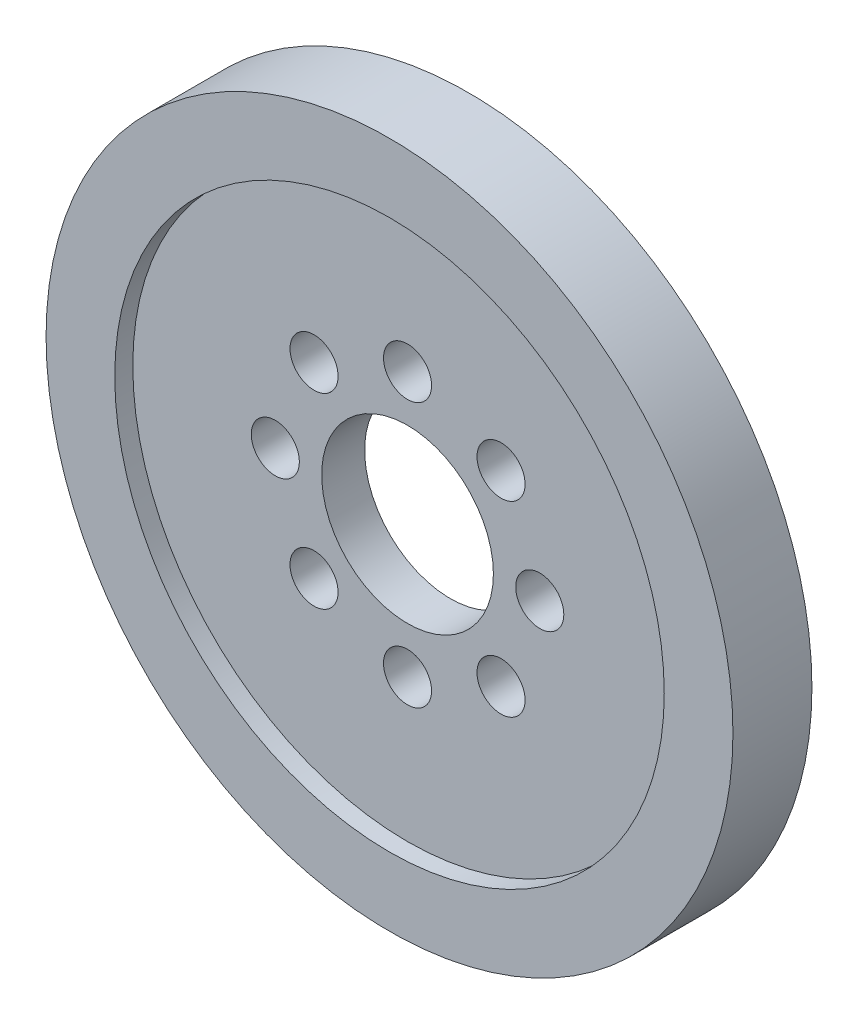
ISO-10303-21;
HEADER;
FILE_DESCRIPTION(('STEP AP214'),'2;1');
FILE_NAME('part.step','',(''),(''),'','','');
FILE_SCHEMA(('AUTOMOTIVE_DESIGN { 1 0 10303 214 1 1 1 1 }'));
ENDSEC;
DATA;
#1=APPLICATION_CONTEXT('core data for automotive mechanical design processes');
#2=APPLICATION_PROTOCOL_DEFINITION('international standard','automotive_design',2000,#1);
#3=PRODUCT_CONTEXT('',#1,'mechanical');
#4=PRODUCT('Part','Part','',(#3));
#5=PRODUCT_RELATED_PRODUCT_CATEGORY('part','',(#4));
#6=PRODUCT_DEFINITION_FORMATION('','',#4);
#7=PRODUCT_DEFINITION_CONTEXT('part definition',#1,'design');
#8=PRODUCT_DEFINITION('design','',#6,#7);
#9=PRODUCT_DEFINITION_SHAPE('','',#8);
#10=(LENGTH_UNIT() NAMED_UNIT(*) SI_UNIT(.MILLI.,.METRE.));
#11=(NAMED_UNIT(*) PLANE_ANGLE_UNIT() SI_UNIT($,.RADIAN.));
#12=(NAMED_UNIT(*) SI_UNIT($,.STERADIAN.) SOLID_ANGLE_UNIT());
#13=UNCERTAINTY_MEASURE_WITH_UNIT(LENGTH_MEASURE(1.E-05),#10,'distance_accuracy_value','');
#14=(GEOMETRIC_REPRESENTATION_CONTEXT(3) GLOBAL_UNCERTAINTY_ASSIGNED_CONTEXT((#13)) GLOBAL_UNIT_ASSIGNED_CONTEXT((#10,
#11,#12)) REPRESENTATION_CONTEXT('',''));
#15=CARTESIAN_POINT('',(0.,0.,0.));
#16=DIRECTION('',(0.,0.,1.));
#17=DIRECTION('',(1.,0.,0.));
#18=AXIS2_PLACEMENT_3D('',#15,#16,#17);
#19=CARTESIAN_POINT('',(0.,0.,2.921));
#20=DIRECTION('',(0.,0.,-1.));
#21=DIRECTION('',(-1.,0.,0.));
#22=AXIS2_PLACEMENT_3D('',#19,#20,#21);
#23=CYLINDRICAL_SURFACE('',#22,20.32);
#24=CARTESIAN_POINT('',(0.,0.,-2.921));
#25=DIRECTION('',(0.,0.,1.));
#26=DIRECTION('',(1.,0.,0.));
#27=AXIS2_PLACEMENT_3D('',#24,#25,#26);
#28=CIRCLE('',#27,20.32);
#29=CARTESIAN_POINT('',(20.32,0.,-2.921));
#30=VERTEX_POINT('',#29);
#31=EDGE_CURVE('E50',#30,#30,#28,.T.);
#32=ORIENTED_EDGE('',*,*,#31,.F.);
#33=EDGE_LOOP('',(#32));
#34=FACE_BOUND('',#33,.T.);
#35=CARTESIAN_POINT('',(0.,0.,-1.5875));
#36=DIRECTION('',(0.,0.,1.));
#37=DIRECTION('',(1.,0.,0.));
#38=AXIS2_PLACEMENT_3D('',#35,#36,#37);
#39=CIRCLE('',#38,20.32);
#40=CARTESIAN_POINT('',(20.32,0.,-1.5875));
#41=VERTEX_POINT('',#40);
#42=EDGE_CURVE('E53',#41,#41,#39,.T.);
#43=ORIENTED_EDGE('',*,*,#42,.T.);
#44=EDGE_LOOP('',(#43));
#45=FACE_BOUND('',#44,.T.);
#46=ADVANCED_FACE('F32',(#34,#45),#23,.F.);
#47=CARTESIAN_POINT('',(0.,0.,2.921));
#48=DIRECTION('',(0.,0.,1.));
#49=DIRECTION('',(1.,0.,0.));
#50=AXIS2_PLACEMENT_3D('',#47,#48,#49);
#51=PLANE('',#50);
#52=CARTESIAN_POINT('',(0.,0.,2.921));
#53=DIRECTION('',(0.,0.,1.));
#54=DIRECTION('',(1.,0.,0.));
#55=AXIS2_PLACEMENT_3D('',#52,#53,#54);
#56=CIRCLE('',#55,25.4);
#57=CARTESIAN_POINT('',(25.4,0.,2.921));
#58=VERTEX_POINT('',#57);
#59=EDGE_CURVE('E39',#58,#58,#56,.T.);
#60=ORIENTED_EDGE('',*,*,#59,.T.);
#61=EDGE_LOOP('',(#60));
#62=FACE_BOUND('',#61,.T.);
#63=CARTESIAN_POINT('',(0.,0.,2.921));
#64=DIRECTION('',(0.,0.,1.));
#65=DIRECTION('',(1.,0.,0.));
#66=AXIS2_PLACEMENT_3D('',#63,#64,#65);
#67=CIRCLE('',#66,20.32);
#68=CARTESIAN_POINT('',(20.32,0.,2.921));
#69=VERTEX_POINT('',#68);
#70=EDGE_CURVE('E48',#69,#69,#67,.T.);
#71=ORIENTED_EDGE('',*,*,#70,.F.);
#72=EDGE_LOOP('',(#71));
#73=FACE_BOUND('',#72,.T.);
#74=ADVANCED_FACE('F135',(#62,#73),#51,.T.);
#75=CARTESIAN_POINT('',(0.,0.,-2.921));
#76=DIRECTION('',(0.,0.,1.));
#77=DIRECTION('',(1.,0.,0.));
#78=AXIS2_PLACEMENT_3D('',#75,#76,#77);
#79=PLANE('',#78);
#80=CARTESIAN_POINT('',(0.,0.,-2.921));
#81=DIRECTION('',(0.,0.,1.));
#82=DIRECTION('',(1.,0.,0.));
#83=AXIS2_PLACEMENT_3D('',#80,#81,#82);
#84=CIRCLE('',#83,25.4);
#85=CARTESIAN_POINT('',(25.4,0.,-2.921));
#86=VERTEX_POINT('',#85);
#87=EDGE_CURVE('E43',#86,#86,#84,.T.);
#88=ORIENTED_EDGE('',*,*,#87,.F.);
#89=EDGE_LOOP('',(#88));
#90=FACE_BOUND('',#89,.T.);
#91=ORIENTED_EDGE('',*,*,#31,.T.);
#92=EDGE_LOOP('',(#91));
#93=FACE_BOUND('',#92,.T.);
#94=ADVANCED_FACE('F140',(#90,#93),#79,.F.);
#95=CARTESIAN_POINT('',(0.,0.,2.921));
#96=DIRECTION('',(0.,0.,-1.));
#97=DIRECTION('',(-1.,0.,0.));
#98=AXIS2_PLACEMENT_3D('',#95,#96,#97);
#99=CYLINDRICAL_SURFACE('',#98,25.4);
#100=ORIENTED_EDGE('',*,*,#59,.F.);
#101=EDGE_LOOP('',(#100));
#102=FACE_BOUND('',#101,.T.);
#103=ORIENTED_EDGE('',*,*,#87,.T.);
#104=EDGE_LOOP('',(#103));
#105=FACE_BOUND('',#104,.T.);
#106=ADVANCED_FACE('F34',(#102,#105),#99,.T.);
#107=CARTESIAN_POINT('',(0.,0.,1.5875));
#108=DIRECTION('',(0.,0.,1.));
#109=DIRECTION('',(1.,0.,0.));
#110=AXIS2_PLACEMENT_3D('',#107,#108,#109);
#111=CIRCLE('',#110,20.32);
#112=CARTESIAN_POINT('',(20.32,0.,1.5875));
#113=VERTEX_POINT('',#112);
#114=EDGE_CURVE('E10',#113,#113,#111,.T.);
#115=ORIENTED_EDGE('',*,*,#114,.F.);
#116=EDGE_LOOP('',(#115));
#117=FACE_BOUND('',#116,.T.);
#118=ORIENTED_EDGE('',*,*,#70,.T.);
#119=EDGE_LOOP('',(#118));
#120=FACE_BOUND('',#119,.T.);
#121=ADVANCED_FACE('F119',(#117,#120),#23,.F.);
#122=CARTESIAN_POINT('',(0.,0.,1.5875));
#123=DIRECTION('',(0.,0.,1.));
#124=DIRECTION('',(1.,0.,0.));
#125=AXIS2_PLACEMENT_3D('',#122,#123,#124);
#126=PLANE('',#125);
#127=CARTESIAN_POINT('',(-9.779,1.02429588037641E-13,1.5875));
#128=DIRECTION('',(0.,0.,1.));
#129=DIRECTION('',(1.,0.,0.));
#130=AXIS2_PLACEMENT_3D('',#127,#128,#129);
#131=CIRCLE('',#130,1.778);
#132=CARTESIAN_POINT('',(-8.001,1.02429588037641E-13,1.5875));
#133=VERTEX_POINT('',#132);
#134=EDGE_CURVE('E98',#133,#133,#131,.T.);
#135=ORIENTED_EDGE('',*,*,#134,.F.);
#136=EDGE_LOOP('',(#135));
#137=FACE_BOUND('',#136,.T.);
#138=CARTESIAN_POINT('',(0.,-9.779,1.5875));
#139=DIRECTION('',(0.,0.,1.));
#140=DIRECTION('',(1.,0.,0.));
#141=AXIS2_PLACEMENT_3D('',#138,#139,#140);
#142=CIRCLE('',#141,1.778);
#143=CARTESIAN_POINT('',(1.77799999999993,-9.779,1.5875));
#144=VERTEX_POINT('',#143);
#145=EDGE_CURVE('E86',#144,#144,#142,.T.);
#146=ORIENTED_EDGE('',*,*,#145,.F.);
#147=EDGE_LOOP('',(#146));
#148=FACE_BOUND('',#147,.T.);
#149=CARTESIAN_POINT('',(9.779,0.,1.5875));
#150=DIRECTION('',(0.,0.,1.));
#151=DIRECTION('',(1.,0.,0.));
#152=AXIS2_PLACEMENT_3D('',#149,#150,#151);
#153=CIRCLE('',#152,1.778);
#154=CARTESIAN_POINT('',(11.557,0.,1.5875));
#155=VERTEX_POINT('',#154);
#156=EDGE_CURVE('E74',#155,#155,#153,.T.);
#157=ORIENTED_EDGE('',*,*,#156,.F.);
#158=EDGE_LOOP('',(#157));
#159=FACE_BOUND('',#158,.T.);
#160=CARTESIAN_POINT('',(0.,9.779,1.5875));
#161=DIRECTION('',(0.,0.,1.));
#162=DIRECTION('',(1.,0.,0.));
#163=AXIS2_PLACEMENT_3D('',#160,#161,#162);
#164=CIRCLE('',#163,1.778);
#165=CARTESIAN_POINT('',(1.778,9.779,1.5875));
#166=VERTEX_POINT('',#165);
#167=EDGE_CURVE('E62',#166,#166,#164,.T.);
#168=ORIENTED_EDGE('',*,*,#167,.F.);
#169=EDGE_LOOP('',(#168));
#170=FACE_BOUND('',#169,.T.);
#171=ORIENTED_EDGE('',*,*,#114,.T.);
#172=EDGE_LOOP('',(#171));
#173=FACE_BOUND('',#172,.T.);
#174=CARTESIAN_POINT('',(0.,0.,1.5875));
#175=DIRECTION('',(0.,0.,1.));
#176=DIRECTION('',(1.,0.,0.));
#177=AXIS2_PLACEMENT_3D('',#174,#175,#176);
#178=CIRCLE('',#177,6.35);
#179=CARTESIAN_POINT('',(6.35,0.,1.5875));
#180=VERTEX_POINT('',#179);
#181=EDGE_CURVE('E58',#180,#180,#178,.T.);
#182=ORIENTED_EDGE('',*,*,#181,.F.);
#183=EDGE_LOOP('',(#182));
#184=FACE_BOUND('',#183,.T.);
#185=CARTESIAN_POINT('',(6.91479721322326,6.91479721322324,1.5875));
#186=DIRECTION('',(0.,0.,1.));
#187=DIRECTION('',(1.,0.,0.));
#188=AXIS2_PLACEMENT_3D('',#185,#186,#187);
#189=CIRCLE('',#188,1.778);
#190=CARTESIAN_POINT('',(8.69279721322326,6.91479721322324,1.5875));
#191=VERTEX_POINT('',#190);
#192=EDGE_CURVE('E68',#191,#191,#189,.T.);
#193=ORIENTED_EDGE('',*,*,#192,.F.);
#194=EDGE_LOOP('',(#193));
#195=FACE_BOUND('',#194,.T.);
#196=CARTESIAN_POINT('',(6.91479721322321,-6.91479721322328,1.5875));
#197=DIRECTION('',(0.,0.,1.));
#198=DIRECTION('',(1.,0.,0.));
#199=AXIS2_PLACEMENT_3D('',#196,#197,#198);
#200=CIRCLE('',#199,1.778);
#201=CARTESIAN_POINT('',(8.69279721322321,-6.91479721322328,1.5875));
#202=VERTEX_POINT('',#201);
#203=EDGE_CURVE('E80',#202,#202,#200,.T.);
#204=ORIENTED_EDGE('',*,*,#203,.F.);
#205=EDGE_LOOP('',(#204));
#206=FACE_BOUND('',#205,.T.);
#207=CARTESIAN_POINT('',(-6.91479721322331,-6.91479721322319,1.5875));
#208=DIRECTION('',(0.,0.,1.));
#209=DIRECTION('',(1.,0.,0.));
#210=AXIS2_PLACEMENT_3D('',#207,#208,#209);
#211=CIRCLE('',#210,1.778);
#212=CARTESIAN_POINT('',(-5.13679721322331,-6.91479721322319,1.5875));
#213=VERTEX_POINT('',#212);
#214=EDGE_CURVE('E92',#213,#213,#211,.T.);
#215=ORIENTED_EDGE('',*,*,#214,.F.);
#216=EDGE_LOOP('',(#215));
#217=FACE_BOUND('',#216,.T.);
#218=CARTESIAN_POINT('',(-6.91479721322316,6.91479721322333,1.5875));
#219=DIRECTION('',(0.,0.,1.));
#220=DIRECTION('',(1.,0.,0.));
#221=AXIS2_PLACEMENT_3D('',#218,#219,#220);
#222=CIRCLE('',#221,1.778);
#223=CARTESIAN_POINT('',(-5.13679721322316,6.91479721322333,1.5875));
#224=VERTEX_POINT('',#223);
#225=EDGE_CURVE('E104',#224,#224,#222,.T.);
#226=ORIENTED_EDGE('',*,*,#225,.F.);
#227=EDGE_LOOP('',(#226));
#228=FACE_BOUND('',#227,.T.);
#229=ADVANCED_FACE('F116',(#137,#148,#159,#170,#173,#184,#195,#206,#217,#228),#126,.T.);
#230=CARTESIAN_POINT('',(0.,0.,-1.5875));
#231=DIRECTION('',(0.,0.,1.));
#232=DIRECTION('',(1.,0.,0.));
#233=AXIS2_PLACEMENT_3D('',#230,#231,#232);
#234=PLANE('',#233);
#235=CARTESIAN_POINT('',(-9.779,1.02429588037641E-13,-1.5875));
#236=DIRECTION('',(0.,0.,1.));
#237=DIRECTION('',(1.,0.,0.));
#238=AXIS2_PLACEMENT_3D('',#235,#236,#237);
#239=CIRCLE('',#238,1.778);
#240=CARTESIAN_POINT('',(-8.001,1.02429588037641E-13,-1.5875));
#241=VERTEX_POINT('',#240);
#242=EDGE_CURVE('E101',#241,#241,#239,.T.);
#243=ORIENTED_EDGE('',*,*,#242,.T.);
#244=EDGE_LOOP('',(#243));
#245=FACE_BOUND('',#244,.T.);
#246=CARTESIAN_POINT('',(0.,-9.779,-1.5875));
#247=DIRECTION('',(0.,0.,1.));
#248=DIRECTION('',(1.,0.,0.));
#249=AXIS2_PLACEMENT_3D('',#246,#247,#248);
#250=CIRCLE('',#249,1.778);
#251=CARTESIAN_POINT('',(1.77799999999993,-9.779,-1.5875));
#252=VERTEX_POINT('',#251);
#253=EDGE_CURVE('E89',#252,#252,#250,.T.);
#254=ORIENTED_EDGE('',*,*,#253,.T.);
#255=EDGE_LOOP('',(#254));
#256=FACE_BOUND('',#255,.T.);
#257=CARTESIAN_POINT('',(9.779,0.,-1.5875));
#258=DIRECTION('',(0.,0.,1.));
#259=DIRECTION('',(1.,0.,0.));
#260=AXIS2_PLACEMENT_3D('',#257,#258,#259);
#261=CIRCLE('',#260,1.778);
#262=CARTESIAN_POINT('',(11.557,0.,-1.5875));
#263=VERTEX_POINT('',#262);
#264=EDGE_CURVE('E77',#263,#263,#261,.T.);
#265=ORIENTED_EDGE('',*,*,#264,.T.);
#266=EDGE_LOOP('',(#265));
#267=FACE_BOUND('',#266,.T.);
#268=CARTESIAN_POINT('',(0.,9.779,-1.5875));
#269=DIRECTION('',(0.,0.,1.));
#270=DIRECTION('',(1.,0.,0.));
#271=AXIS2_PLACEMENT_3D('',#268,#269,#270);
#272=CIRCLE('',#271,1.778);
#273=CARTESIAN_POINT('',(1.778,9.779,-1.5875));
#274=VERTEX_POINT('',#273);
#275=EDGE_CURVE('E65',#274,#274,#272,.T.);
#276=ORIENTED_EDGE('',*,*,#275,.T.);
#277=EDGE_LOOP('',(#276));
#278=FACE_BOUND('',#277,.T.);
#279=ORIENTED_EDGE('',*,*,#42,.F.);
#280=EDGE_LOOP('',(#279));
#281=FACE_BOUND('',#280,.T.);
#282=CARTESIAN_POINT('',(0.,0.,-1.5875));
#283=DIRECTION('',(0.,0.,1.));
#284=DIRECTION('',(1.,0.,0.));
#285=AXIS2_PLACEMENT_3D('',#282,#283,#284);
#286=CIRCLE('',#285,6.35);
#287=CARTESIAN_POINT('',(6.35,0.,-1.5875));
#288=VERTEX_POINT('',#287);
#289=EDGE_CURVE('E59',#288,#288,#286,.T.);
#290=ORIENTED_EDGE('',*,*,#289,.T.);
#291=EDGE_LOOP('',(#290));
#292=FACE_BOUND('',#291,.T.);
#293=CARTESIAN_POINT('',(6.91479721322326,6.91479721322324,-1.5875));
#294=DIRECTION('',(0.,0.,1.));
#295=DIRECTION('',(1.,0.,0.));
#296=AXIS2_PLACEMENT_3D('',#293,#294,#295);
#297=CIRCLE('',#296,1.778);
#298=CARTESIAN_POINT('',(8.69279721322326,6.91479721322324,-1.5875));
#299=VERTEX_POINT('',#298);
#300=EDGE_CURVE('E71',#299,#299,#297,.T.);
#301=ORIENTED_EDGE('',*,*,#300,.T.);
#302=EDGE_LOOP('',(#301));
#303=FACE_BOUND('',#302,.T.);
#304=CARTESIAN_POINT('',(6.91479721322321,-6.91479721322328,-1.5875));
#305=DIRECTION('',(0.,0.,1.));
#306=DIRECTION('',(1.,0.,0.));
#307=AXIS2_PLACEMENT_3D('',#304,#305,#306);
#308=CIRCLE('',#307,1.778);
#309=CARTESIAN_POINT('',(8.69279721322321,-6.91479721322328,-1.5875));
#310=VERTEX_POINT('',#309);
#311=EDGE_CURVE('E83',#310,#310,#308,.T.);
#312=ORIENTED_EDGE('',*,*,#311,.T.);
#313=EDGE_LOOP('',(#312));
#314=FACE_BOUND('',#313,.T.);
#315=CARTESIAN_POINT('',(-6.91479721322331,-6.91479721322319,-1.5875));
#316=DIRECTION('',(0.,0.,1.));
#317=DIRECTION('',(1.,0.,0.));
#318=AXIS2_PLACEMENT_3D('',#315,#316,#317);
#319=CIRCLE('',#318,1.778);
#320=CARTESIAN_POINT('',(-5.13679721322331,-6.91479721322319,-1.5875));
#321=VERTEX_POINT('',#320);
#322=EDGE_CURVE('E95',#321,#321,#319,.T.);
#323=ORIENTED_EDGE('',*,*,#322,.T.);
#324=EDGE_LOOP('',(#323));
#325=FACE_BOUND('',#324,.T.);
#326=CARTESIAN_POINT('',(-6.91479721322316,6.91479721322333,-1.5875));
#327=DIRECTION('',(0.,0.,1.));
#328=DIRECTION('',(1.,0.,0.));
#329=AXIS2_PLACEMENT_3D('',#326,#327,#328);
#330=CIRCLE('',#329,1.778);
#331=CARTESIAN_POINT('',(-5.13679721322316,6.91479721322333,-1.5875));
#332=VERTEX_POINT('',#331);
#333=EDGE_CURVE('E107',#332,#332,#330,.T.);
#334=ORIENTED_EDGE('',*,*,#333,.T.);
#335=EDGE_LOOP('',(#334));
#336=FACE_BOUND('',#335,.T.);
#337=ADVANCED_FACE('F118',(#245,#256,#267,#278,#281,#292,#303,#314,#325,#336),#234,.F.);
#338=CARTESIAN_POINT('',(0.,0.,1.5875));
#339=DIRECTION('',(0.,0.,-1.));
#340=DIRECTION('',(-1.,0.,0.));
#341=AXIS2_PLACEMENT_3D('',#338,#339,#340);
#342=CYLINDRICAL_SURFACE('',#341,6.35);
#343=ORIENTED_EDGE('',*,*,#181,.T.);
#344=EDGE_LOOP('',(#343));
#345=FACE_BOUND('',#344,.T.);
#346=ORIENTED_EDGE('',*,*,#289,.F.);
#347=EDGE_LOOP('',(#346));
#348=FACE_BOUND('',#347,.T.);
#349=ADVANCED_FACE('F126',(#345,#348),#342,.F.);
#350=CARTESIAN_POINT('',(0.,9.779,1.5875));
#351=DIRECTION('',(0.,0.,-1.));
#352=DIRECTION('',(-1.,0.,0.));
#353=AXIS2_PLACEMENT_3D('',#350,#351,#352);
#354=CYLINDRICAL_SURFACE('',#353,1.778);
#355=ORIENTED_EDGE('',*,*,#167,.T.);
#356=EDGE_LOOP('',(#355));
#357=FACE_BOUND('',#356,.T.);
#358=ORIENTED_EDGE('',*,*,#275,.F.);
#359=EDGE_LOOP('',(#358));
#360=FACE_BOUND('',#359,.T.);
#361=ADVANCED_FACE('F180',(#357,#360),#354,.F.);
#362=CARTESIAN_POINT('',(6.91479721322326,6.91479721322324,1.5875));
#363=DIRECTION('',(0.,0.,-1.));
#364=DIRECTION('',(-1.,0.,0.));
#365=AXIS2_PLACEMENT_3D('',#362,#363,#364);
#366=CYLINDRICAL_SURFACE('',#365,1.778);
#367=ORIENTED_EDGE('',*,*,#192,.T.);
#368=EDGE_LOOP('',(#367));
#369=FACE_BOUND('',#368,.T.);
#370=ORIENTED_EDGE('',*,*,#300,.F.);
#371=EDGE_LOOP('',(#370));
#372=FACE_BOUND('',#371,.T.);
#373=ADVANCED_FACE('F189',(#369,#372),#366,.F.);
#374=CARTESIAN_POINT('',(9.779,0.,1.5875));
#375=DIRECTION('',(0.,0.,-1.));
#376=DIRECTION('',(-1.,0.,0.));
#377=AXIS2_PLACEMENT_3D('',#374,#375,#376);
#378=CYLINDRICAL_SURFACE('',#377,1.778);
#379=ORIENTED_EDGE('',*,*,#156,.T.);
#380=EDGE_LOOP('',(#379));
#381=FACE_BOUND('',#380,.T.);
#382=ORIENTED_EDGE('',*,*,#264,.F.);
#383=EDGE_LOOP('',(#382));
#384=FACE_BOUND('',#383,.T.);
#385=ADVANCED_FACE('F199',(#381,#384),#378,.F.);
#386=CARTESIAN_POINT('',(6.91479721322321,-6.91479721322328,1.5875));
#387=DIRECTION('',(0.,0.,-1.));
#388=DIRECTION('',(-1.,0.,0.));
#389=AXIS2_PLACEMENT_3D('',#386,#387,#388);
#390=CYLINDRICAL_SURFACE('',#389,1.778);
#391=ORIENTED_EDGE('',*,*,#203,.T.);
#392=EDGE_LOOP('',(#391));
#393=FACE_BOUND('',#392,.T.);
#394=ORIENTED_EDGE('',*,*,#311,.F.);
#395=EDGE_LOOP('',(#394));
#396=FACE_BOUND('',#395,.T.);
#397=ADVANCED_FACE('F209',(#393,#396),#390,.F.);
#398=CARTESIAN_POINT('',(0.,-9.779,1.5875));
#399=DIRECTION('',(0.,0.,-1.));
#400=DIRECTION('',(-1.,0.,0.));
#401=AXIS2_PLACEMENT_3D('',#398,#399,#400);
#402=CYLINDRICAL_SURFACE('',#401,1.778);
#403=ORIENTED_EDGE('',*,*,#145,.T.);
#404=EDGE_LOOP('',(#403));
#405=FACE_BOUND('',#404,.T.);
#406=ORIENTED_EDGE('',*,*,#253,.F.);
#407=EDGE_LOOP('',(#406));
#408=FACE_BOUND('',#407,.T.);
#409=ADVANCED_FACE('F219',(#405,#408),#402,.F.);
#410=CARTESIAN_POINT('',(-6.91479721322331,-6.91479721322319,1.5875));
#411=DIRECTION('',(0.,0.,-1.));
#412=DIRECTION('',(-1.,0.,0.));
#413=AXIS2_PLACEMENT_3D('',#410,#411,#412);
#414=CYLINDRICAL_SURFACE('',#413,1.778);
#415=ORIENTED_EDGE('',*,*,#214,.T.);
#416=EDGE_LOOP('',(#415));
#417=FACE_BOUND('',#416,.T.);
#418=ORIENTED_EDGE('',*,*,#322,.F.);
#419=EDGE_LOOP('',(#418));
#420=FACE_BOUND('',#419,.T.);
#421=ADVANCED_FACE('F229',(#417,#420),#414,.F.);
#422=CARTESIAN_POINT('',(-9.779,1.02429588037641E-13,1.5875));
#423=DIRECTION('',(0.,0.,-1.));
#424=DIRECTION('',(-1.,0.,0.));
#425=AXIS2_PLACEMENT_3D('',#422,#423,#424);
#426=CYLINDRICAL_SURFACE('',#425,1.778);
#427=ORIENTED_EDGE('',*,*,#134,.T.);
#428=EDGE_LOOP('',(#427));
#429=FACE_BOUND('',#428,.T.);
#430=ORIENTED_EDGE('',*,*,#242,.F.);
#431=EDGE_LOOP('',(#430));
#432=FACE_BOUND('',#431,.T.);
#433=ADVANCED_FACE('F239',(#429,#432),#426,.F.);
#434=CARTESIAN_POINT('',(-6.91479721322316,6.91479721322333,1.5875));
#435=DIRECTION('',(0.,0.,-1.));
#436=DIRECTION('',(-1.,0.,0.));
#437=AXIS2_PLACEMENT_3D('',#434,#435,#436);
#438=CYLINDRICAL_SURFACE('',#437,1.778);
#439=ORIENTED_EDGE('',*,*,#225,.T.);
#440=EDGE_LOOP('',(#439));
#441=FACE_BOUND('',#440,.T.);
#442=ORIENTED_EDGE('',*,*,#333,.F.);
#443=EDGE_LOOP('',(#442));
#444=FACE_BOUND('',#443,.T.);
#445=ADVANCED_FACE('F113',(#441,#444),#438,.F.);
#446=CLOSED_SHELL('',(#46,#74,#94,#106,#121,#229,#337,#349,#361,#373,#385,#397,#409,#421,#433,#445));
#447=MANIFOLD_SOLID_BREP('B2',#446);
#448=ADVANCED_BREP_SHAPE_REPRESENTATION('',(#18,#447),#14);
#449=SHAPE_DEFINITION_REPRESENTATION(#9,#448);
ENDSEC;
END-ISO-10303-21;
